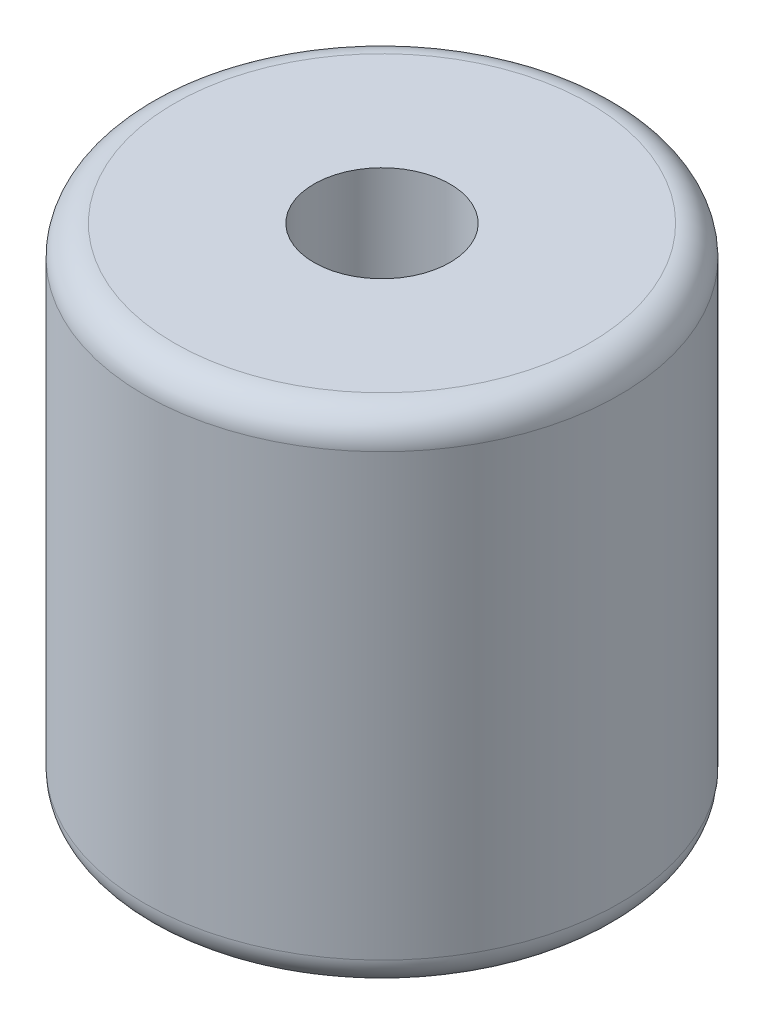
ISO-10303-21;
HEADER;
FILE_DESCRIPTION(('STEP AP214'),'2;1');
FILE_NAME('part.step','',(''),(''),'','','');
FILE_SCHEMA(('AUTOMOTIVE_DESIGN { 1 0 10303 214 1 1 1 1 }'));
ENDSEC;
DATA;
#1=APPLICATION_CONTEXT('core data for automotive mechanical design processes');
#2=APPLICATION_PROTOCOL_DEFINITION('international standard','automotive_design',2000,#1);
#3=PRODUCT_CONTEXT('',#1,'mechanical');
#4=PRODUCT('Part','Part','',(#3));
#5=PRODUCT_RELATED_PRODUCT_CATEGORY('part','',(#4));
#6=PRODUCT_DEFINITION_FORMATION('','',#4);
#7=PRODUCT_DEFINITION_CONTEXT('part definition',#1,'design');
#8=PRODUCT_DEFINITION('design','',#6,#7);
#9=PRODUCT_DEFINITION_SHAPE('','',#8);
#10=(LENGTH_UNIT() NAMED_UNIT(*) SI_UNIT(.MILLI.,.METRE.));
#11=(NAMED_UNIT(*) PLANE_ANGLE_UNIT() SI_UNIT($,.RADIAN.));
#12=(NAMED_UNIT(*) SI_UNIT($,.STERADIAN.) SOLID_ANGLE_UNIT());
#13=UNCERTAINTY_MEASURE_WITH_UNIT(LENGTH_MEASURE(1.E-05),#10,'distance_accuracy_value','');
#14=(GEOMETRIC_REPRESENTATION_CONTEXT(3) GLOBAL_UNCERTAINTY_ASSIGNED_CONTEXT((#13)) GLOBAL_UNIT_ASSIGNED_CONTEXT((#10,
#11,#12)) REPRESENTATION_CONTEXT('',''));
#15=CARTESIAN_POINT('',(0.,0.,0.));
#16=DIRECTION('',(0.,0.,1.));
#17=DIRECTION('',(1.,0.,0.));
#18=AXIS2_PLACEMENT_3D('',#15,#16,#17);
#19=CARTESIAN_POINT('',(0.,12.7,0.));
#20=DIRECTION('',(0.,-1.,0.));
#21=DIRECTION('',(0.,0.,-1.));
#22=AXIS2_PLACEMENT_3D('',#19,#20,#21);
#23=CYLINDRICAL_SURFACE('',#22,6.0325);
#24=CARTESIAN_POINT('',(0.,0.76,0.));
#25=DIRECTION('',(0.,1.,0.));
#26=DIRECTION('',(0.,0.,1.));
#27=AXIS2_PLACEMENT_3D('',#24,#25,#26);
#28=CIRCLE('',#27,6.0325);
#29=CARTESIAN_POINT('',(0.,0.76,6.0325));
#30=VERTEX_POINT('',#29);
#31=EDGE_CURVE('E60',#30,#30,#28,.T.);
#32=ORIENTED_EDGE('',*,*,#31,.T.);
#33=EDGE_LOOP('',(#32));
#34=FACE_BOUND('',#33,.T.);
#35=CARTESIAN_POINT('',(0.,11.94,0.));
#36=DIRECTION('',(0.,1.,0.));
#37=DIRECTION('',(0.,0.,1.));
#38=AXIS2_PLACEMENT_3D('',#35,#36,#37);
#39=CIRCLE('',#38,6.0325);
#40=CARTESIAN_POINT('',(0.,11.94,6.0325));
#41=VERTEX_POINT('',#40);
#42=EDGE_CURVE('E56',#41,#41,#39,.F.);
#43=ORIENTED_EDGE('',*,*,#42,.T.);
#44=EDGE_LOOP('',(#43));
#45=FACE_BOUND('',#44,.T.);
#46=ADVANCED_FACE('F37',(#34,#45),#23,.T.);
#47=CARTESIAN_POINT('',(0.,12.7,0.));
#48=DIRECTION('',(0.,1.,0.));
#49=DIRECTION('',(0.,0.,1.));
#50=AXIS2_PLACEMENT_3D('',#47,#48,#49);
#51=PLANE('',#50);
#52=CARTESIAN_POINT('',(0.,12.7,0.));
#53=DIRECTION('',(0.,1.,0.));
#54=DIRECTION('',(0.,0.,1.));
#55=AXIS2_PLACEMENT_3D('',#52,#53,#54);
#56=CIRCLE('',#55,1.72719999999999);
#57=CARTESIAN_POINT('',(0.,12.7,1.72719999999999));
#58=VERTEX_POINT('',#57);
#59=EDGE_CURVE('E57',#58,#58,#56,.T.);
#60=ORIENTED_EDGE('',*,*,#59,.F.);
#61=EDGE_LOOP('',(#60));
#62=FACE_BOUND('',#61,.T.);
#63=CARTESIAN_POINT('',(0.,12.7,0.));
#64=DIRECTION('',(0.,1.,0.));
#65=DIRECTION('',(0.,0.,1.));
#66=AXIS2_PLACEMENT_3D('',#63,#64,#65);
#67=CIRCLE('',#66,5.2725);
#68=CARTESIAN_POINT('',(0.,12.7,5.2725));
#69=VERTEX_POINT('',#68);
#70=EDGE_CURVE('E11',#69,#69,#67,.T.);
#71=ORIENTED_EDGE('',*,*,#70,.T.);
#72=EDGE_LOOP('',(#71));
#73=FACE_BOUND('',#72,.T.);
#74=ADVANCED_FACE('F78',(#62,#73),#51,.T.);
#75=CARTESIAN_POINT('',(0.,0.,0.));
#76=DIRECTION('',(0.,1.,0.));
#77=DIRECTION('',(0.,0.,1.));
#78=AXIS2_PLACEMENT_3D('',#75,#76,#77);
#79=PLANE('',#78);
#80=CARTESIAN_POINT('',(0.,0.,0.));
#81=DIRECTION('',(0.,1.,0.));
#82=DIRECTION('',(0.,0.,1.));
#83=AXIS2_PLACEMENT_3D('',#80,#81,#82);
#84=CIRCLE('',#83,5.2725);
#85=CARTESIAN_POINT('',(0.,0.,5.2725));
#86=VERTEX_POINT('',#85);
#87=EDGE_CURVE('E44',#86,#86,#84,.F.);
#88=ORIENTED_EDGE('',*,*,#87,.T.);
#89=EDGE_LOOP('',(#88));
#90=FACE_BOUND('',#89,.T.);
#91=ADVANCED_FACE('F69',(#90),#79,.F.);
#92=CARTESIAN_POINT('',(0.,0.76,0.));
#93=DIRECTION('',(0.,1.,0.));
#94=DIRECTION('',(0.,0.,1.));
#95=AXIS2_PLACEMENT_3D('',#92,#93,#94);
#96=TOROIDAL_SURFACE('',#95,5.2725,0.76);
#97=ORIENTED_EDGE('',*,*,#87,.F.);
#98=EDGE_LOOP('',(#97));
#99=FACE_BOUND('',#98,.T.);
#100=ORIENTED_EDGE('',*,*,#31,.F.);
#101=EDGE_LOOP('',(#100));
#102=FACE_BOUND('',#101,.T.);
#103=ADVANCED_FACE('F71',(#99,#102),#96,.T.);
#104=CARTESIAN_POINT('',(0.,11.94,0.));
#105=DIRECTION('',(0.,1.,0.));
#106=DIRECTION('',(0.,0.,1.));
#107=AXIS2_PLACEMENT_3D('',#104,#105,#106);
#108=TOROIDAL_SURFACE('',#107,5.2725,0.76);
#109=ORIENTED_EDGE('',*,*,#42,.F.);
#110=EDGE_LOOP('',(#109));
#111=FACE_BOUND('',#110,.T.);
#112=ORIENTED_EDGE('',*,*,#70,.F.);
#113=EDGE_LOOP('',(#112));
#114=FACE_BOUND('',#113,.T.);
#115=ADVANCED_FACE('F39',(#111,#114),#108,.T.);
#116=CARTESIAN_POINT('',(0.,1.27,0.));
#117=DIRECTION('',(0.,1.,0.));
#118=DIRECTION('',(0.,0.,1.));
#119=AXIS2_PLACEMENT_3D('',#116,#117,#118);
#120=CONICAL_SURFACE('',#119,1.7272,1.02974425867665);
#121=CARTESIAN_POINT('',(0.,0.232193538815595,0.));
#122=VERTEX_POINT('',#121);
#123=VERTEX_LOOP('',#122);
#124=FACE_BOUND('',#123,.T.);
#125=CARTESIAN_POINT('',(0.,1.27,0.));
#126=DIRECTION('',(0.,1.,0.));
#127=DIRECTION('',(0.,0.,1.));
#128=AXIS2_PLACEMENT_3D('',#125,#126,#127);
#129=CIRCLE('',#128,1.7272);
#130=CARTESIAN_POINT('',(0.,1.27,1.7272));
#131=VERTEX_POINT('',#130);
#132=EDGE_CURVE('E54',#131,#131,#129,.T.);
#133=ORIENTED_EDGE('',*,*,#132,.T.);
#134=EDGE_LOOP('',(#133));
#135=FACE_BOUND('',#134,.T.);
#136=ADVANCED_FACE('F47',(#124,#135),#120,.F.);
#137=CARTESIAN_POINT('',(0.,12.7,0.));
#138=DIRECTION('',(0.,1.,0.));
#139=DIRECTION('',(0.,0.,1.));
#140=AXIS2_PLACEMENT_3D('',#137,#138,#139);
#141=CYLINDRICAL_SURFACE('',#140,1.72719999999999);
#142=ORIENTED_EDGE('',*,*,#132,.F.);
#143=EDGE_LOOP('',(#142));
#144=FACE_BOUND('',#143,.T.);
#145=ORIENTED_EDGE('',*,*,#59,.T.);
#146=EDGE_LOOP('',(#145));
#147=FACE_BOUND('',#146,.T.);
#148=ADVANCED_FACE('F50',(#144,#147),#141,.F.);
#149=CLOSED_SHELL('',(#46,#74,#91,#103,#115,#136,#148));
#150=MANIFOLD_SOLID_BREP('B2',#149);
#151=ADVANCED_BREP_SHAPE_REPRESENTATION('',(#18,#150),#14);
#152=SHAPE_DEFINITION_REPRESENTATION(#9,#151);
ENDSEC;
END-ISO-10303-21;
